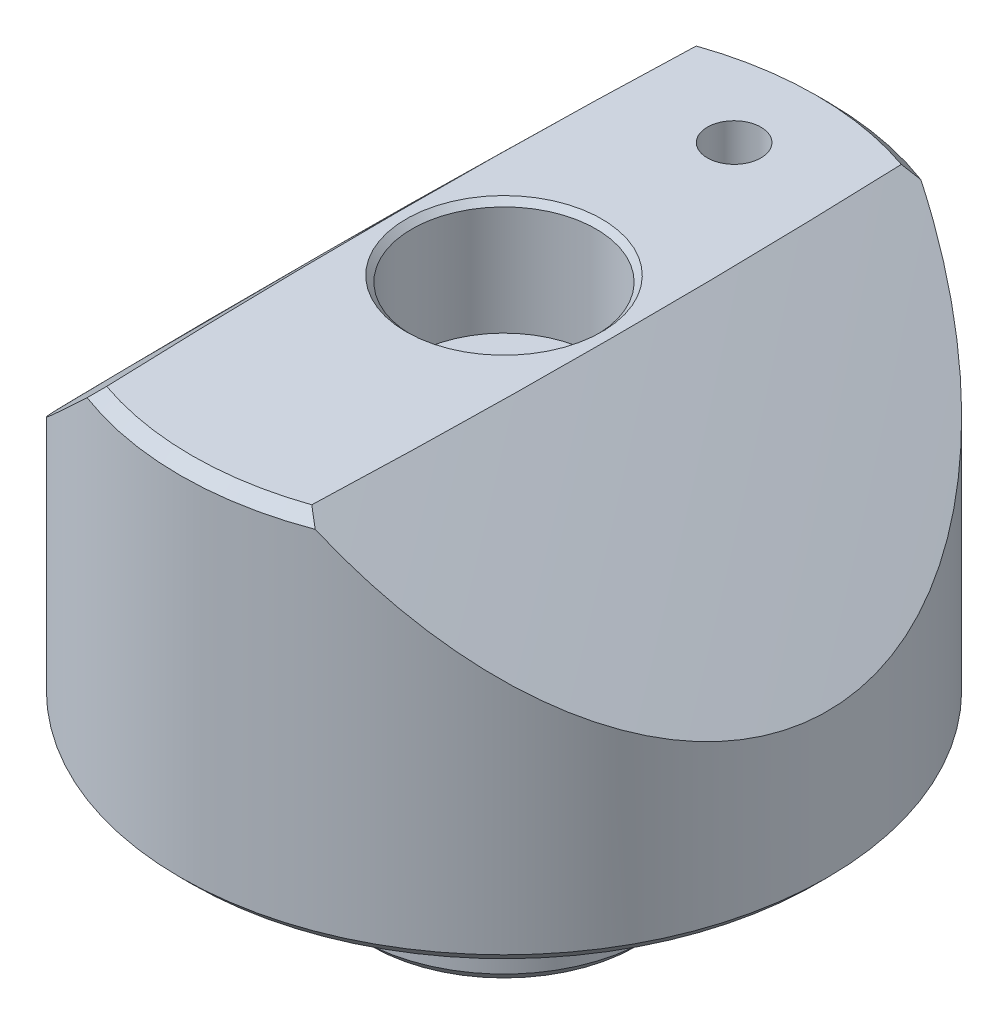
ISO-10303-21;
HEADER;
FILE_DESCRIPTION(('STEP AP214'),'2;1');
FILE_NAME('part.step','',(''),(''),'','','');
FILE_SCHEMA(('AUTOMOTIVE_DESIGN { 1 0 10303 214 1 1 1 1 }'));
ENDSEC;
DATA;
#1=APPLICATION_CONTEXT('core data for automotive mechanical design processes');
#2=APPLICATION_PROTOCOL_DEFINITION('international standard','automotive_design',2000,#1);
#3=PRODUCT_CONTEXT('',#1,'mechanical');
#4=PRODUCT('Part','Part','',(#3));
#5=PRODUCT_RELATED_PRODUCT_CATEGORY('part','',(#4));
#6=PRODUCT_DEFINITION_FORMATION('','',#4);
#7=PRODUCT_DEFINITION_CONTEXT('part definition',#1,'design');
#8=PRODUCT_DEFINITION('design','',#6,#7);
#9=PRODUCT_DEFINITION_SHAPE('','',#8);
#10=(LENGTH_UNIT() NAMED_UNIT(*) SI_UNIT(.MILLI.,.METRE.));
#11=(NAMED_UNIT(*) PLANE_ANGLE_UNIT() SI_UNIT($,.RADIAN.));
#12=(NAMED_UNIT(*) SI_UNIT($,.STERADIAN.) SOLID_ANGLE_UNIT());
#13=UNCERTAINTY_MEASURE_WITH_UNIT(LENGTH_MEASURE(1.E-05),#10,'distance_accuracy_value','');
#14=(GEOMETRIC_REPRESENTATION_CONTEXT(3) GLOBAL_UNCERTAINTY_ASSIGNED_CONTEXT((#13)) GLOBAL_UNIT_ASSIGNED_CONTEXT((#10,
#11,#12)) REPRESENTATION_CONTEXT('',''));
#15=CARTESIAN_POINT('',(0.,0.,0.));
#16=DIRECTION('',(0.,0.,1.));
#17=DIRECTION('',(1.,0.,0.));
#18=AXIS2_PLACEMENT_3D('',#15,#16,#17);
#19=CARTESIAN_POINT('',(0.,0.,0.));
#20=DIRECTION('',(0.,1.,0.));
#21=DIRECTION('',(0.,0.,1.));
#22=AXIS2_PLACEMENT_3D('',#19,#20,#21);
#23=PLANE('',#22);
#24=CARTESIAN_POINT('',(0.,0.,-10.16));
#25=DIRECTION('',(0.,1.,0.));
#26=DIRECTION('',(0.,0.,1.));
#27=AXIS2_PLACEMENT_3D('',#24,#25,#26);
#28=CIRCLE('',#27,1.1811);
#29=CARTESIAN_POINT('',(0.,0.,-8.9789));
#30=VERTEX_POINT('',#29);
#31=EDGE_CURVE('E181',#30,#30,#28,.T.);
#32=ORIENTED_EDGE('',*,*,#31,.T.);
#33=EDGE_LOOP('',(#32));
#34=FACE_BOUND('',#33,.T.);
#35=CARTESIAN_POINT('',(0.,0.,0.));
#36=DIRECTION('',(0.,1.,0.));
#37=DIRECTION('',(0.,0.,1.));
#38=AXIS2_PLACEMENT_3D('',#35,#36,#37);
#39=CIRCLE('',#38,13.7795);
#40=CARTESIAN_POINT('',(0.,0.,13.7795));
#41=VERTEX_POINT('',#40);
#42=EDGE_CURVE('E108',#41,#41,#39,.F.);
#43=ORIENTED_EDGE('',*,*,#42,.T.);
#44=EDGE_LOOP('',(#43));
#45=FACE_BOUND('',#44,.T.);
#46=CARTESIAN_POINT('',(0.,0.,0.));
#47=DIRECTION('',(0.,1.,0.));
#48=DIRECTION('',(0.,0.,1.));
#49=AXIS2_PLACEMENT_3D('',#46,#47,#48);
#50=CIRCLE('',#49,7.24802561210692);
#51=CARTESIAN_POINT('',(0.,0.,7.24802561210692));
#52=VERTEX_POINT('',#51);
#53=EDGE_CURVE('E219',#52,#52,#50,.F.);
#54=ORIENTED_EDGE('',*,*,#53,.F.);
#55=EDGE_LOOP('',(#54));
#56=FACE_BOUND('',#55,.T.);
#57=ADVANCED_FACE('F34',(#34,#45,#56),#23,.F.);
#58=CARTESIAN_POINT('',(0.,16.383,0.));
#59=DIRECTION('',(0.,-1.,0.));
#60=DIRECTION('',(0.,0.,-1.));
#61=AXIS2_PLACEMENT_3D('',#58,#59,#60);
#62=CONICAL_SURFACE('',#61,13.7795,0.785398163397452);
#63=CARTESIAN_POINT('',(0.,16.383,0.));
#64=DIRECTION('',(0.,1.,0.));
#65=DIRECTION('',(0.,0.,1.));
#66=AXIS2_PLACEMENT_3D('',#63,#64,#65);
#67=CIRCLE('',#66,13.7795);
#68=CARTESIAN_POINT('',(4.52742325237346,16.383,-13.0144941870158));
#69=VERTEX_POINT('',#68);
#70=CARTESIAN_POINT('',(-4.52742325237346,16.383,-13.0144941870158));
#71=VERTEX_POINT('',#70);
#72=EDGE_CURVE('E113',#69,#71,#67,.T.);
#73=ORIENTED_EDGE('',*,*,#72,.F.);
#74=CARTESIAN_POINT('',(4.52722295690128,16.3832,-13.014352107904));
#75=CARTESIAN_POINT('',(4.61181805516265,16.2987301324419,-13.074348995123));
#76=CARTESIAN_POINT('',(4.69648227601538,16.2141285269333,-13.1340594733926));
#77=CARTESIAN_POINT('',(4.86594894271498,16.0446618602039,-13.2529075978746));
#78=CARTESIAN_POINT('',(4.9507513885289,15.9597967990458,-13.3120452442235));
#79=CARTESIAN_POINT('',(5.03562295690124,15.8748,-13.3708964817595));
#80=B_SPLINE_CURVE_WITH_KNOTS('',3,(#74,#75,#76,#77,#78,#79),.UNSPECIFIED.,.F.,.F.,(4,2,4),(0.,
0.401269520972732,0.802538946338954),.UNSPECIFIED.);
#81=CARTESIAN_POINT('',(5.03542325237344,15.875,-13.3707579784939));
#82=VERTEX_POINT('',#81);
#83=EDGE_CURVE('E94',#69,#82,#80,.T.);
#84=ORIENTED_EDGE('',*,*,#83,.T.);
#85=CARTESIAN_POINT('',(0.,15.875,0.));
#86=DIRECTION('',(0.,1.,0.));
#87=DIRECTION('',(0.,0.,1.));
#88=AXIS2_PLACEMENT_3D('',#85,#86,#87);
#89=CIRCLE('',#88,14.2875);
#90=CARTESIAN_POINT('',(-5.03542325237344,15.875,-13.3707579784939));
#91=VERTEX_POINT('',#90);
#92=EDGE_CURVE('E93',#91,#82,#89,.F.);
#93=ORIENTED_EDGE('',*,*,#92,.F.);
#94=CARTESIAN_POINT('',(-5.03562295690127,15.8748,-13.3708964817595));
#95=CARTESIAN_POINT('',(-4.95075138852892,15.9597967990458,-13.3120452442235));
#96=CARTESIAN_POINT('',(-4.86594894271499,16.0446618602039,-13.2529075978746));
#97=CARTESIAN_POINT('',(-4.69648227601538,16.2141285269333,-13.1340594733926));
#98=CARTESIAN_POINT('',(-4.61181805516264,16.2987301324419,-13.074348995123));
#99=CARTESIAN_POINT('',(-4.52722295690125,16.3832,-13.0143521079041));
#100=B_SPLINE_CURVE_WITH_KNOTS('',3,(#94,#95,#96,#97,#98,#99),.UNSPECIFIED.,.F.,.F.,(4,2,4),(0.,
0.401269425366218,0.802538946338953),.UNSPECIFIED.);
#101=EDGE_CURVE('E148',#91,#71,#100,.T.);
#102=ORIENTED_EDGE('',*,*,#101,.T.);
#103=EDGE_LOOP('',(#73,#84,#93,#102));
#104=FACE_BOUND('',#103,.T.);
#105=ADVANCED_FACE('F124',(#104),#62,.T.);
#106=CARTESIAN_POINT('',(0.,16.383,0.));
#107=DIRECTION('',(0.,-1.,0.));
#108=DIRECTION('',(0.,0.,-1.));
#109=AXIS2_PLACEMENT_3D('',#106,#107,#108);
#110=CYLINDRICAL_SURFACE('',#109,14.2875);
#111=CARTESIAN_POINT('',(0.,0.508000000000005,0.));
#112=DIRECTION('',(0.,1.,0.));
#113=DIRECTION('',(0.,0.,1.));
#114=AXIS2_PLACEMENT_3D('',#111,#112,#113);
#115=CIRCLE('',#114,14.2875);
#116=CARTESIAN_POINT('',(0.,0.508000000000005,14.2875));
#117=VERTEX_POINT('',#116);
#118=EDGE_CURVE('E100',#117,#117,#115,.T.);
#119=ORIENTED_EDGE('',*,*,#118,.T.);
#120=EDGE_LOOP('',(#119));
#121=FACE_BOUND('',#120,.T.);
#122=CARTESIAN_POINT('',(5.03521524078568,15.8752000000002,13.3708363137449));
#123=CARTESIAN_POINT('',(5.24435047936504,15.6741198731854,13.2920736008828));
#124=CARTESIAN_POINT('',(5.45237204060643,15.4739405681317,13.2081398792422));
#125=CARTESIAN_POINT('',(5.86591596766525,15.0756560246645,13.0297522154154));
#126=CARTESIAN_POINT('',(6.07143808076123,14.87755099626,12.935297219063));
#127=CARTESIAN_POINT('',(6.68444450340339,14.2861798689911,12.6355856316907));
#128=CARTESIAN_POINT('',(7.08769096439448,13.8965096184802,12.4142358873083));
#129=CARTESIAN_POINT('',(7.88387411481151,13.1259046146372,11.9246813301953));
#130=CARTESIAN_POINT('',(8.2766499157757,12.7451119182438,11.65599077169));
#131=CARTESIAN_POINT('',(9.04307893881021,12.0009166142973,11.0719131725258));
#132=CARTESIAN_POINT('',(9.41674727932048,11.6375002732749,10.7565638438743));
#133=CARTESIAN_POINT('',(10.0296132340179,11.0405814861955,10.1812653448069));
#134=CARTESIAN_POINT('',(10.2750060441701,10.8013189333861,9.93383922131895));
#135=CARTESIAN_POINT('',(10.752370776612,10.3354294090908,9.41506382339818));
#136=CARTESIAN_POINT('',(10.9843408618971,10.1088041672727,9.14371128721441));
#137=CARTESIAN_POINT('',(11.4316780846879,9.67137824042843,8.57782141172306));
#138=CARTESIAN_POINT('',(11.6471014328251,9.46052405028466,8.28337012330595));
#139=CARTESIAN_POINT('',(12.059553412734,9.05648537191586,7.67047396148952));
#140=CARTESIAN_POINT('',(12.2565878987981,8.86329526054134,7.35203678300022));
#141=CARTESIAN_POINT('',(12.5924282420514,8.5337631838079,6.75691899714235));
#142=CARTESIAN_POINT('',(12.7350453383546,8.39373264647383,6.48442680497846));
#143=CARTESIAN_POINT('',(13.0047674981344,8.12875985680675,5.92495110820769));
#144=CARTESIAN_POINT('',(13.131880165856,8.00381020827421,5.6379748058617));
#145=CARTESIAN_POINT('',(13.3689162418281,7.77069905118793,5.05026241003214));
#146=CARTESIAN_POINT('',(13.4788343388799,7.66254272996996,4.74952210194278));
#147=CARTESIAN_POINT('',(13.6796361150475,7.4648830553673,4.135752660442));
#148=CARTESIAN_POINT('',(13.7705196180322,7.37537987458408,3.82272341335027));
#149=CARTESIAN_POINT('',(13.9322291776594,7.21607872104049,3.18358385502761));
#150=CARTESIAN_POINT('',(14.0028782275511,7.14645466210971,2.8573849883133));
#151=CARTESIAN_POINT('',(14.1215669504467,7.02946390504839,2.19694072635212));
#152=CARTESIAN_POINT('',(14.1696065197624,6.98209730899174,1.86269529421066));
#153=CARTESIAN_POINT('',(14.2419286655316,6.91078088176215,1.1894012772535));
#154=CARTESIAN_POINT('',(14.2662284338308,6.88681410495877,0.850356348910398));
#155=CARTESIAN_POINT('',(14.2905278845514,6.86284767059779,0.170571456286731));
#156=CARTESIAN_POINT('',(14.290530749317,6.86284487430124,-0.170168280166154));
#157=CARTESIAN_POINT('',(14.2679222423542,6.88514348424529,-0.803249986841322));
#158=CARTESIAN_POINT('',(14.2484125311997,6.90438575213812,-1.09582001186282));
#159=CARTESIAN_POINT('',(14.1916858889861,6.96032583001074,-1.67752216949968));
#160=CARTESIAN_POINT('',(14.1544709367755,6.99702168926789,-1.96665468261218));
#161=CARTESIAN_POINT('',(14.0629817853964,7.08721384972374,-2.53956178885961));
#162=CARTESIAN_POINT('',(14.0087056616879,7.14071204626468,-2.82333577370998));
#163=CARTESIAN_POINT('',(13.8839851327656,7.26360812758226,-3.38379119827849));
#164=CARTESIAN_POINT('',(13.813539872834,7.3330068528775,-3.6604722621974));
#165=CARTESIAN_POINT('',(13.6567016858424,7.48745889337918,-4.20822923010808));
#166=CARTESIAN_POINT('',(13.5701455087197,7.57267242988083,-4.47921294191804));
#167=CARTESIAN_POINT('',(13.382759400332,7.75707300775283,-5.01138988309089));
#168=CARTESIAN_POINT('',(13.2819247179018,7.85626470029431,-5.27257981684105));
#169=CARTESIAN_POINT('',(13.0672684367221,8.06732166505759,-5.78412155354329));
#170=CARTESIAN_POINT('',(12.9534519131542,8.17918198442751,-6.03447753952665));
#171=CARTESIAN_POINT('',(12.713993335665,8.41440021404323,-6.52390131336048));
#172=CARTESIAN_POINT('',(12.5883487644383,8.53776057173131,-6.76296668195289));
#173=CARTESIAN_POINT('',(12.2606252772963,8.85934119569476,-7.3465021503992));
#174=CARTESIAN_POINT('',(12.0518324665611,9.06406052265623,-7.68365838010624));
#175=CARTESIAN_POINT('',(11.6137204059389,9.4932113028934,-8.33109208190593));
#176=CARTESIAN_POINT('',(11.3843913015231,9.71765221877498,-8.64135650767014));
#177=CARTESIAN_POINT('',(10.9072621936464,10.1841295456204,-9.23636181820497));
#178=CARTESIAN_POINT('',(10.6593800120737,10.4262441063731,-9.52097513720146));
#179=CARTESIAN_POINT('',(10.1489147134787,10.9242874140674,-10.0633424565146));
#180=CARTESIAN_POINT('',(9.88633534378695,11.1802126391232,-10.321103255872));
#181=CARTESIAN_POINT('',(9.26554673238644,11.784579872323,-10.8861756285345));
#182=CARTESIAN_POINT('',(8.9028697457337,12.1371631834772,-11.184169772111));
#183=CARTESIAN_POINT('',(8.16026051987733,12.8579761029716,-11.7370040789373));
#184=CARTESIAN_POINT('',(7.7803173927044,13.2262155743342,-11.9918165193151));
#185=CARTESIAN_POINT('',(7.01162857844479,13.9700271393307,-12.456680217414));
#186=CARTESIAN_POINT('',(6.6230526398135,14.3454497211574,-12.6672519100146));
#187=CARTESIAN_POINT('',(6.03268473594591,14.9149100257504,-12.9532658741737));
#188=CARTESIAN_POINT('',(5.83478000039933,15.1056544966023,-13.043579345899));
#189=CARTESIAN_POINT('',(5.43666536822023,15.4890548590001,-13.2144697878173));
#190=CARTESIAN_POINT('',(5.23645566818627,15.6817105873372,-13.2950475817599));
#191=CARTESIAN_POINT('',(5.03521524078563,15.8752000000001,-13.3708363137449));
#192=B_SPLINE_CURVE_WITH_KNOTS('',3,(#122,#123,#124,#125,#126,#127,#128,#129,#130,#131,#132,
#133,#134,#135,#136,#137,#138,#139,#140,#141,#142,#143,#144,#145,#146,#147,#148,#149,#150,#151,
#152,#153,#154,#155,#156,#157,#158,#159,#160,#161,#162,#163,#164,#165,#166,#167,#168,#169,#170,
#171,#172,#173,#174,#175,#176,#177,#178,#179,#180,#181,#182,#183,#184,#185,#186,#187,#188,#189,
#190,#191),.UNSPECIFIED.,.F.,.F.,(4,2,2,2,2,2,2,2,2,2,2,2,2,2,2,2,2,2,2,2,2,2,2,2,2,2,2,2,2,2,2,
2,2,2,4),(0.,0.901770943201729,1.80363231963582,3.61027002537981,5.43665700748803,
7.26157579343089,8.52876707651852,9.79613137641681,11.0589801266956,12.321425454142,
13.3343231512112,14.3467220514192,15.3594330547526,16.3721534284998,17.3934796809797,
18.4148106172693,19.4354013785202,20.4558584654833,21.3363521046419,22.2167473574352,
23.0972419565257,23.9777831102259,24.8677872427461,25.7580882226542,26.6480423294917,
27.5381862709587,28.8750608793705,30.2125804725693,31.5564217351691,32.8999219067661,
34.6587760730672,36.4187551895694,38.1567008888143,39.0245105459874,39.8922467250579),.UNSPECIFIED.);
#193=CARTESIAN_POINT('',(5.03542325237342,15.875,13.3707579784939));
#194=VERTEX_POINT('',#193);
#195=EDGE_CURVE('E82',#194,#82,#192,.T.);
#196=ORIENTED_EDGE('',*,*,#195,.F.);
#197=CARTESIAN_POINT('',(-5.03542325237338,15.875,13.3707579784939));
#198=VERTEX_POINT('',#197);
#199=EDGE_CURVE('E57',#194,#198,#89,.F.);
#200=ORIENTED_EDGE('',*,*,#199,.T.);
#201=CARTESIAN_POINT('',(-5.03521524078568,15.8752000000002,-13.3708363137449));
#202=CARTESIAN_POINT('',(-5.24435047936504,15.6741198731854,-13.2920736008828));
#203=CARTESIAN_POINT('',(-5.45237204060643,15.4739405681317,-13.2081398792422));
#204=CARTESIAN_POINT('',(-5.86591596766525,15.0756560246645,-13.0297522154154));
#205=CARTESIAN_POINT('',(-6.07143808076123,14.87755099626,-12.935297219063));
#206=CARTESIAN_POINT('',(-6.68444450340339,14.2861798689911,-12.6355856316907));
#207=CARTESIAN_POINT('',(-7.08769096439448,13.8965096184802,-12.4142358873083));
#208=CARTESIAN_POINT('',(-7.88387411481151,13.1259046146372,-11.9246813301953));
#209=CARTESIAN_POINT('',(-8.2766499157757,12.7451119182438,-11.65599077169));
#210=CARTESIAN_POINT('',(-9.04307893881021,12.0009166142973,-11.0719131725258));
#211=CARTESIAN_POINT('',(-9.41674727932048,11.6375002732749,-10.7565638438743));
#212=CARTESIAN_POINT('',(-10.0296132340179,11.0405814861955,-10.1812653448069));
#213=CARTESIAN_POINT('',(-10.2750060441701,10.8013189333861,-9.93383922131895));
#214=CARTESIAN_POINT('',(-10.752370776612,10.3354294090908,-9.41506382339818));
#215=CARTESIAN_POINT('',(-10.9843408618971,10.1088041672727,-9.14371128721441));
#216=CARTESIAN_POINT('',(-11.4316780846879,9.67137824042843,-8.57782141172306));
#217=CARTESIAN_POINT('',(-11.6471014328251,9.46052405028466,-8.28337012330595));
#218=CARTESIAN_POINT('',(-12.059553412734,9.05648537191586,-7.67047396148952));
#219=CARTESIAN_POINT('',(-12.2565878987981,8.86329526054134,-7.35203678300022));
#220=CARTESIAN_POINT('',(-12.5924282420514,8.5337631838079,-6.75691899714235));
#221=CARTESIAN_POINT('',(-12.7350453383546,8.39373264647383,-6.48442680497846));
#222=CARTESIAN_POINT('',(-13.0047674981344,8.12875985680675,-5.92495110820769));
#223=CARTESIAN_POINT('',(-13.131880165856,8.00381020827421,-5.6379748058617));
#224=CARTESIAN_POINT('',(-13.3689162418281,7.77069905118793,-5.05026241003214));
#225=CARTESIAN_POINT('',(-13.4788343388799,7.66254272996996,-4.74952210194278));
#226=CARTESIAN_POINT('',(-13.6796361150475,7.4648830553673,-4.135752660442));
#227=CARTESIAN_POINT('',(-13.7705196180322,7.37537987458408,-3.82272341335027));
#228=CARTESIAN_POINT('',(-13.9322291776594,7.21607872104049,-3.18358385502761));
#229=CARTESIAN_POINT('',(-14.0028782275511,7.14645466210971,-2.8573849883133));
#230=CARTESIAN_POINT('',(-14.1215669504467,7.02946390504839,-2.19694072635212));
#231=CARTESIAN_POINT('',(-14.1696065197624,6.98209730899174,-1.86269529421066));
#232=CARTESIAN_POINT('',(-14.2419286655316,6.91078088176215,-1.1894012772535));
#233=CARTESIAN_POINT('',(-14.2662284338308,6.88681410495877,-0.850356348910398));
#234=CARTESIAN_POINT('',(-14.2905278845514,6.86284767059779,-0.170571456286731));
#235=CARTESIAN_POINT('',(-14.290530749317,6.86284487430124,0.170168280166154));
#236=CARTESIAN_POINT('',(-14.2679222423542,6.88514348424529,0.803249986841322));
#237=CARTESIAN_POINT('',(-14.2484125311997,6.90438575213812,1.09582001186282));
#238=CARTESIAN_POINT('',(-14.1916858889861,6.96032583001074,1.67752216949968));
#239=CARTESIAN_POINT('',(-14.1544709367755,6.99702168926789,1.96665468261218));
#240=CARTESIAN_POINT('',(-14.0629817853964,7.08721384972374,2.53956178885961));
#241=CARTESIAN_POINT('',(-14.0087056616879,7.14071204626468,2.82333577370998));
#242=CARTESIAN_POINT('',(-13.8839851327656,7.26360812758226,3.38379119827849));
#243=CARTESIAN_POINT('',(-13.813539872834,7.3330068528775,3.6604722621974));
#244=CARTESIAN_POINT('',(-13.6567016858424,7.48745889337918,4.20822923010808));
#245=CARTESIAN_POINT('',(-13.5701455087197,7.57267242988083,4.47921294191804));
#246=CARTESIAN_POINT('',(-13.382759400332,7.75707300775283,5.01138988309089));
#247=CARTESIAN_POINT('',(-13.2819247179018,7.85626470029431,5.27257981684105));
#248=CARTESIAN_POINT('',(-13.0672684367221,8.06732166505759,5.78412155354329));
#249=CARTESIAN_POINT('',(-12.9534519131542,8.17918198442751,6.03447753952665));
#250=CARTESIAN_POINT('',(-12.713993335665,8.41440021404323,6.52390131336048));
#251=CARTESIAN_POINT('',(-12.5883487644383,8.53776057173131,6.76296668195289));
#252=CARTESIAN_POINT('',(-12.2606252772963,8.85934119569476,7.3465021503992));
#253=CARTESIAN_POINT('',(-12.0518324665611,9.06406052265623,7.68365838010624));
#254=CARTESIAN_POINT('',(-11.6137204059389,9.4932113028934,8.33109208190593));
#255=CARTESIAN_POINT('',(-11.3843913015231,9.71765221877498,8.64135650767014));
#256=CARTESIAN_POINT('',(-10.9072621936464,10.1841295456204,9.23636181820497));
#257=CARTESIAN_POINT('',(-10.6593800120737,10.4262441063731,9.52097513720146));
#258=CARTESIAN_POINT('',(-10.1489147134787,10.9242874140674,10.0633424565146));
#259=CARTESIAN_POINT('',(-9.88633534378695,11.1802126391232,10.321103255872));
#260=CARTESIAN_POINT('',(-9.26554673238644,11.784579872323,10.8861756285345));
#261=CARTESIAN_POINT('',(-8.9028697457337,12.1371631834772,11.184169772111));
#262=CARTESIAN_POINT('',(-8.16026051987733,12.8579761029716,11.7370040789373));
#263=CARTESIAN_POINT('',(-7.7803173927044,13.2262155743342,11.9918165193151));
#264=CARTESIAN_POINT('',(-7.01162857844479,13.9700271393307,12.456680217414));
#265=CARTESIAN_POINT('',(-6.6230526398135,14.3454497211574,12.6672519100146));
#266=CARTESIAN_POINT('',(-6.03268473594591,14.9149100257504,12.9532658741737));
#267=CARTESIAN_POINT('',(-5.83478000039933,15.1056544966023,13.043579345899));
#268=CARTESIAN_POINT('',(-5.43666536822023,15.4890548590001,13.2144697878173));
#269=CARTESIAN_POINT('',(-5.23645566818627,15.6817105873372,13.2950475817599));
#270=CARTESIAN_POINT('',(-5.03521524078563,15.8752000000001,13.3708363137449));
#271=B_SPLINE_CURVE_WITH_KNOTS('',3,(#201,#202,#203,#204,#205,#206,#207,#208,#209,#210,#211,
#212,#213,#214,#215,#216,#217,#218,#219,#220,#221,#222,#223,#224,#225,#226,#227,#228,#229,#230,
#231,#232,#233,#234,#235,#236,#237,#238,#239,#240,#241,#242,#243,#244,#245,#246,#247,#248,#249,
#250,#251,#252,#253,#254,#255,#256,#257,#258,#259,#260,#261,#262,#263,#264,#265,#266,#267,#268,
#269,#270),.UNSPECIFIED.,.F.,.F.,(4,2,2,2,2,2,2,2,2,2,2,2,2,2,2,2,2,2,2,2,2,2,2,2,2,2,2,2,2,2,2,
2,2,2,4),(0.,0.901770943201729,1.80363231963582,3.61027002537981,5.43665700748803,
7.26157579343089,8.52876707651852,9.79613137641681,11.0589801266956,12.321425454142,
13.3343231512112,14.3467220514192,15.3594330547526,16.3721534284998,17.3934796809797,
18.4148106172693,19.4354013785202,20.4558584654833,21.3363521046419,22.2167473574352,
23.0972419565257,23.9777831102259,24.8677872427461,25.7580882226542,26.6480423294917,
27.5381862709587,28.8750608793705,30.2125804725693,31.5564217351691,32.8999219067661,
34.6587760730672,36.4187551895694,38.1567008888143,39.0245105459874,39.8922467250579),.UNSPECIFIED.);
#272=EDGE_CURVE('E142',#91,#198,#271,.T.);
#273=ORIENTED_EDGE('',*,*,#272,.F.);
#274=ORIENTED_EDGE('',*,*,#92,.T.);
#275=EDGE_LOOP('',(#196,#200,#273,#274));
#276=FACE_BOUND('',#275,.T.);
#277=ADVANCED_FACE('F91',(#121,#276),#110,.T.);
#278=CARTESIAN_POINT('',(0.,16.383,0.));
#279=DIRECTION('',(0.,1.,0.));
#280=DIRECTION('',(0.,0.,1.));
#281=AXIS2_PLACEMENT_3D('',#278,#279,#280);
#282=PLANE('',#281);
#283=CARTESIAN_POINT('',(0.,16.383,0.));
#284=DIRECTION('',(0.,1.,0.));
#285=DIRECTION('',(0.,0.,1.));
#286=AXIS2_PLACEMENT_3D('',#283,#284,#285);
#287=CIRCLE('',#286,4.31800000000001);
#288=CARTESIAN_POINT('',(0.,16.383,4.31800000000001));
#289=VERTEX_POINT('',#288);
#290=EDGE_CURVE('E11',#289,#289,#287,.F.);
#291=ORIENTED_EDGE('',*,*,#290,.T.);
#292=EDGE_LOOP('',(#291));
#293=FACE_BOUND('',#292,.T.);
#294=CARTESIAN_POINT('',(0.,16.383,-10.16));
#295=DIRECTION('',(0.,1.,0.));
#296=DIRECTION('',(0.,0.,1.));
#297=AXIS2_PLACEMENT_3D('',#294,#295,#296);
#298=CIRCLE('',#297,1.1811);
#299=CARTESIAN_POINT('',(0.,16.383,-8.9789));
#300=VERTEX_POINT('',#299);
#301=EDGE_CURVE('E179',#300,#300,#298,.T.);
#302=ORIENTED_EDGE('',*,*,#301,.F.);
#303=EDGE_LOOP('',(#302));
#304=FACE_BOUND('',#303,.T.);
#305=CARTESIAN_POINT('',(-4.52742325237346,16.383,13.0144941870158));
#306=VERTEX_POINT('',#305);
#307=CARTESIAN_POINT('',(4.5274232523735,16.383,13.0144941870158));
#308=VERTEX_POINT('',#307);
#309=EDGE_CURVE('E111',#306,#308,#67,.T.);
#310=ORIENTED_EDGE('',*,*,#309,.T.);
#311=CARTESIAN_POINT('',(-343.991741395694,16.383,0.));
#312=DIRECTION('',(0.,1.,0.));
#313=DIRECTION('',(0.,0.,1.));
#314=AXIS2_PLACEMENT_3D('',#311,#312,#313);
#315=CIRCLE('',#314,348.762075326333);
#316=EDGE_CURVE('E49',#308,#69,#315,.T.);
#317=ORIENTED_EDGE('',*,*,#316,.T.);
#318=ORIENTED_EDGE('',*,*,#72,.T.);
#319=CARTESIAN_POINT('',(343.991741395694,16.383,0.));
#320=DIRECTION('',(0.,1.,0.));
#321=DIRECTION('',(0.,0.,1.));
#322=AXIS2_PLACEMENT_3D('',#319,#320,#321);
#323=CIRCLE('',#322,348.762075326333);
#324=EDGE_CURVE('E149',#71,#306,#323,.T.);
#325=ORIENTED_EDGE('',*,*,#324,.T.);
#326=EDGE_LOOP('',(#310,#317,#318,#325));
#327=FACE_BOUND('',#326,.T.);
#328=ADVANCED_FACE('F159',(#293,#304,#327),#282,.T.);
#329=ORIENTED_EDGE('',*,*,#199,.F.);
#330=CARTESIAN_POINT('',(5.03562295690128,15.8748,13.3708964817595));
#331=CARTESIAN_POINT('',(4.95075138852893,15.9597967990458,13.3120452442235));
#332=CARTESIAN_POINT('',(4.86594894271499,16.0446618602039,13.2529075978746));
#333=CARTESIAN_POINT('',(4.69648227601538,16.2141285269333,13.1340594733926));
#334=CARTESIAN_POINT('',(4.61181805516264,16.2987301324419,13.074348995123));
#335=CARTESIAN_POINT('',(4.52722295690126,16.3832,13.014352107904));
#336=B_SPLINE_CURVE_WITH_KNOTS('',3,(#330,#331,#332,#333,#334,#335),.UNSPECIFIED.,.F.,.F.,(4,2,
4),(0.,0.401269425366218,0.802538946338952),.UNSPECIFIED.);
#337=EDGE_CURVE('E80',#194,#308,#336,.T.);
#338=ORIENTED_EDGE('',*,*,#337,.T.);
#339=ORIENTED_EDGE('',*,*,#309,.F.);
#340=CARTESIAN_POINT('',(-4.52722295690127,16.3832,13.014352107904));
#341=CARTESIAN_POINT('',(-4.61181805516266,16.2987301324419,13.074348995123));
#342=CARTESIAN_POINT('',(-4.6964822760154,16.2141285269333,13.1340594733926));
#343=CARTESIAN_POINT('',(-4.86594894271501,16.0446618602039,13.2529075978746));
#344=CARTESIAN_POINT('',(-4.95075138852894,15.9597967990458,13.3120452442235));
#345=CARTESIAN_POINT('',(-5.03562295690129,15.8748,13.3708964817595));
#346=B_SPLINE_CURVE_WITH_KNOTS('',3,(#340,#341,#342,#343,#344,#345),.UNSPECIFIED.,.F.,.F.,(4,2,
4),(0.,0.401269520972735,0.802538946338954),.UNSPECIFIED.);
#347=EDGE_CURVE('E88',#306,#198,#346,.T.);
#348=ORIENTED_EDGE('',*,*,#347,.T.);
#349=EDGE_LOOP('',(#329,#338,#339,#348));
#350=FACE_BOUND('',#349,.T.);
#351=ADVANCED_FACE('F97',(#350),#62,.T.);
#352=CARTESIAN_POINT('',(0.,-6.35,-10.16));
#353=DIRECTION('',(0.,1.,0.));
#354=DIRECTION('',(0.,0.,1.));
#355=AXIS2_PLACEMENT_3D('',#352,#353,#354);
#356=CYLINDRICAL_SURFACE('',#355,1.1811);
#357=ORIENTED_EDGE('',*,*,#301,.T.);
#358=EDGE_LOOP('',(#357));
#359=FACE_BOUND('',#358,.T.);
#360=ORIENTED_EDGE('',*,*,#31,.F.);
#361=EDGE_LOOP('',(#360));
#362=FACE_BOUND('',#361,.T.);
#363=ADVANCED_FACE('F136',(#359,#362),#356,.F.);
#364=CARTESIAN_POINT('',(0.,0.508000000000005,0.));
#365=DIRECTION('',(0.,1.,0.));
#366=DIRECTION('',(0.,0.,1.));
#367=AXIS2_PLACEMENT_3D('',#364,#365,#366);
#368=CONICAL_SURFACE('',#367,14.2875,0.78539816339745);
#369=ORIENTED_EDGE('',*,*,#42,.F.);
#370=EDGE_LOOP('',(#369));
#371=FACE_BOUND('',#370,.T.);
#372=ORIENTED_EDGE('',*,*,#118,.F.);
#373=EDGE_LOOP('',(#372));
#374=FACE_BOUND('',#373,.T.);
#375=ADVANCED_FACE('F132',(#371,#374),#368,.T.);
#376=CARTESIAN_POINT('',(343.991741395694,-341.896241395688,0.));
#377=DIRECTION('',(0.,-1.,0.));
#378=DIRECTION('',(-0.999048221581858,0.,0.0436193873653361));
#379=AXIS2_PLACEMENT_3D('',#376,#377,#378);
#380=SPHERICAL_SURFACE('',#379,499.999);
#381=CARTESIAN_POINT('',(-9.56094209080183,11.6564420908017,0.));
#382=VERTEX_POINT('',#381);
#383=VERTEX_LOOP('',#382);
#384=FACE_BOUND('',#383,.T.);
#385=ORIENTED_EDGE('',*,*,#272,.T.);
#386=ORIENTED_EDGE('',*,*,#347,.F.);
#387=ORIENTED_EDGE('',*,*,#324,.F.);
#388=ORIENTED_EDGE('',*,*,#101,.F.);
#389=EDGE_LOOP('',(#385,#386,#387,#388));
#390=FACE_BOUND('',#389,.T.);
#391=ADVANCED_FACE('F128',(#384,#390),#380,.T.);
#392=CARTESIAN_POINT('',(-343.991741395694,-341.896241395688,0.));
#393=DIRECTION('',(0.,-1.,0.));
#394=DIRECTION('',(0.999048221581858,0.,0.0436193873653361));
#395=AXIS2_PLACEMENT_3D('',#392,#393,#394);
#396=SPHERICAL_SURFACE('',#395,499.999);
#397=CARTESIAN_POINT('',(9.56094209079561,11.656442090808,0.));
#398=VERTEX_POINT('',#397);
#399=VERTEX_LOOP('',#398);
#400=FACE_BOUND('',#399,.T.);
#401=ORIENTED_EDGE('',*,*,#316,.F.);
#402=ORIENTED_EDGE('',*,*,#337,.F.);
#403=ORIENTED_EDGE('',*,*,#195,.T.);
#404=ORIENTED_EDGE('',*,*,#83,.F.);
#405=EDGE_LOOP('',(#401,#402,#403,#404));
#406=FACE_BOUND('',#405,.T.);
#407=ADVANCED_FACE('F81',(#400,#406),#396,.T.);
#408=CARTESIAN_POINT('',(0.,-0.449012806053458,0.));
#409=DIRECTION('',(0.,1.,0.));
#410=DIRECTION('',(0.,0.,1.));
#411=AXIS2_PLACEMENT_3D('',#408,#409,#410);
#412=TOROIDAL_SURFACE('',#411,6.79901280605346,0.635000000000001);
#413=ORIENTED_EDGE('',*,*,#53,.T.);
#414=EDGE_LOOP('',(#413));
#415=FACE_BOUND('',#414,.T.);
#416=CARTESIAN_POINT('',(0.,-0.898025612106916,0.));
#417=DIRECTION('',(0.,1.,0.));
#418=DIRECTION('',(0.,0.,1.));
#419=AXIS2_PLACEMENT_3D('',#416,#417,#418);
#420=CIRCLE('',#419,6.35);
#421=CARTESIAN_POINT('',(0.,-0.898025612106916,6.35));
#422=VERTEX_POINT('',#421);
#423=EDGE_CURVE('E221',#422,#422,#420,.T.);
#424=ORIENTED_EDGE('',*,*,#423,.T.);
#425=EDGE_LOOP('',(#424));
#426=FACE_BOUND('',#425,.T.);
#427=ADVANCED_FACE('F203',(#415,#426),#412,.F.);
#428=CARTESIAN_POINT('',(0.,-6.35,0.));
#429=DIRECTION('',(0.,-1.,0.));
#430=DIRECTION('',(0.,0.,-1.));
#431=AXIS2_PLACEMENT_3D('',#428,#429,#430);
#432=PLANE('',#431);
#433=CARTESIAN_POINT('',(0.,-6.35,0.));
#434=DIRECTION('',(0.,-1.,0.));
#435=DIRECTION('',(0.,0.,-1.));
#436=AXIS2_PLACEMENT_3D('',#433,#434,#435);
#437=CIRCLE('',#436,2.80669999999997);
#438=CARTESIAN_POINT('',(0.,-6.35,-2.80669999999997));
#439=VERTEX_POINT('',#438);
#440=EDGE_CURVE('E350',#439,#439,#437,.F.);
#441=ORIENTED_EDGE('',*,*,#440,.T.);
#442=EDGE_LOOP('',(#441));
#443=FACE_BOUND('',#442,.T.);
#444=CARTESIAN_POINT('',(0.,-6.35,0.));
#445=DIRECTION('',(0.,-1.,0.));
#446=DIRECTION('',(0.,0.,-1.));
#447=AXIS2_PLACEMENT_3D('',#444,#445,#446);
#448=CIRCLE('',#447,5.84199999999999);
#449=CARTESIAN_POINT('',(0.,-6.35,-5.84199999999999));
#450=VERTEX_POINT('',#449);
#451=EDGE_CURVE('E102',#450,#450,#448,.T.);
#452=ORIENTED_EDGE('',*,*,#451,.T.);
#453=EDGE_LOOP('',(#452));
#454=FACE_BOUND('',#453,.T.);
#455=ADVANCED_FACE('F189',(#443,#454),#432,.T.);
#456=CARTESIAN_POINT('',(0.,-6.35,0.));
#457=DIRECTION('',(0.,1.,0.));
#458=DIRECTION('',(0.,0.,1.));
#459=AXIS2_PLACEMENT_3D('',#456,#457,#458);
#460=CONICAL_SURFACE('',#459,5.84199999999999,0.785398163397454);
#461=CARTESIAN_POINT('',(0.,-5.842,0.));
#462=DIRECTION('',(0.,-1.,0.));
#463=DIRECTION('',(0.,0.,-1.));
#464=AXIS2_PLACEMENT_3D('',#461,#462,#463);
#465=CIRCLE('',#464,6.35);
#466=CARTESIAN_POINT('',(0.,-5.842,-6.35));
#467=VERTEX_POINT('',#466);
#468=EDGE_CURVE('E98',#467,#467,#465,.F.);
#469=ORIENTED_EDGE('',*,*,#468,.F.);
#470=EDGE_LOOP('',(#469));
#471=FACE_BOUND('',#470,.T.);
#472=ORIENTED_EDGE('',*,*,#451,.F.);
#473=EDGE_LOOP('',(#472));
#474=FACE_BOUND('',#473,.T.);
#475=ADVANCED_FACE('F162',(#471,#474),#460,.T.);
#476=CARTESIAN_POINT('',(0.,-6.35,0.));
#477=DIRECTION('',(0.,1.,0.));
#478=DIRECTION('',(0.,0.,1.));
#479=AXIS2_PLACEMENT_3D('',#476,#477,#478);
#480=CYLINDRICAL_SURFACE('',#479,6.35);
#481=ORIENTED_EDGE('',*,*,#468,.T.);
#482=EDGE_LOOP('',(#481));
#483=FACE_BOUND('',#482,.T.);
#484=ORIENTED_EDGE('',*,*,#423,.F.);
#485=EDGE_LOOP('',(#484));
#486=FACE_BOUND('',#485,.T.);
#487=ADVANCED_FACE('F192',(#483,#486),#480,.T.);
#488=CARTESIAN_POINT('',(0.,16.383,0.));
#489=DIRECTION('',(0.,1.,0.));
#490=DIRECTION('',(0.,0.,1.));
#491=AXIS2_PLACEMENT_3D('',#488,#489,#490);
#492=CYLINDRICAL_SURFACE('',#491,2.55269999999999);
#493=CARTESIAN_POINT('',(0.,11.049,0.));
#494=DIRECTION('',(0.,-1.,0.));
#495=DIRECTION('',(0.,0.,-1.));
#496=AXIS2_PLACEMENT_3D('',#493,#494,#495);
#497=CIRCLE('',#496,2.55269999999999);
#498=CARTESIAN_POINT('',(0.,11.049,-2.55269999999999));
#499=VERTEX_POINT('',#498);
#500=EDGE_CURVE('E357',#499,#499,#497,.F.);
#501=ORIENTED_EDGE('',*,*,#500,.T.);
#502=EDGE_LOOP('',(#501));
#503=FACE_BOUND('',#502,.T.);
#504=CARTESIAN_POINT('',(0.,-6.09600000000001,0.));
#505=DIRECTION('',(0.,-1.,0.));
#506=DIRECTION('',(0.,0.,-1.));
#507=AXIS2_PLACEMENT_3D('',#504,#505,#506);
#508=CIRCLE('',#507,2.55269999999999);
#509=CARTESIAN_POINT('',(0.,-6.09600000000001,-2.55269999999999));
#510=VERTEX_POINT('',#509);
#511=EDGE_CURVE('E87',#510,#510,#508,.T.);
#512=ORIENTED_EDGE('',*,*,#511,.T.);
#513=EDGE_LOOP('',(#512));
#514=FACE_BOUND('',#513,.T.);
#515=ADVANCED_FACE('F199',(#503,#514),#492,.F.);
#516=CARTESIAN_POINT('',(0.,11.303,0.));
#517=DIRECTION('',(0.,-1.,0.));
#518=DIRECTION('',(0.,0.,-1.));
#519=AXIS2_PLACEMENT_3D('',#516,#517,#518);
#520=PLANE('',#519);
#521=CARTESIAN_POINT('',(0.,11.303,0.));
#522=DIRECTION('',(0.,-1.,0.));
#523=DIRECTION('',(0.,0.,-1.));
#524=AXIS2_PLACEMENT_3D('',#521,#522,#523);
#525=CIRCLE('',#524,2.80669999999999);
#526=CARTESIAN_POINT('',(0.,11.303,-2.80669999999999));
#527=VERTEX_POINT('',#526);
#528=EDGE_CURVE('E352',#527,#527,#525,.T.);
#529=ORIENTED_EDGE('',*,*,#528,.T.);
#530=EDGE_LOOP('',(#529));
#531=FACE_BOUND('',#530,.T.);
#532=CARTESIAN_POINT('',(0.,11.303,0.));
#533=DIRECTION('',(0.,1.,0.));
#534=DIRECTION('',(0.,0.,1.));
#535=AXIS2_PLACEMENT_3D('',#532,#533,#534);
#536=CIRCLE('',#535,4.06400000000001);
#537=CARTESIAN_POINT('',(0.,11.303,4.06400000000001));
#538=VERTEX_POINT('',#537);
#539=EDGE_CURVE('E223',#538,#538,#536,.T.);
#540=ORIENTED_EDGE('',*,*,#539,.T.);
#541=EDGE_LOOP('',(#540));
#542=FACE_BOUND('',#541,.T.);
#543=ADVANCED_FACE('F228',(#531,#542),#520,.F.);
#544=CARTESIAN_POINT('',(0.,16.383,0.));
#545=DIRECTION('',(0.,1.,0.));
#546=DIRECTION('',(0.,0.,1.));
#547=AXIS2_PLACEMENT_3D('',#544,#545,#546);
#548=CYLINDRICAL_SURFACE('',#547,4.06400000000001);
#549=CARTESIAN_POINT('',(0.,16.129,0.));
#550=DIRECTION('',(0.,1.,0.));
#551=DIRECTION('',(0.,0.,1.));
#552=AXIS2_PLACEMENT_3D('',#549,#550,#551);
#553=CIRCLE('',#552,4.06400000000001);
#554=CARTESIAN_POINT('',(0.,16.129,4.06400000000001));
#555=VERTEX_POINT('',#554);
#556=EDGE_CURVE('E42',#555,#555,#553,.T.);
#557=ORIENTED_EDGE('',*,*,#556,.T.);
#558=EDGE_LOOP('',(#557));
#559=FACE_BOUND('',#558,.T.);
#560=ORIENTED_EDGE('',*,*,#539,.F.);
#561=EDGE_LOOP('',(#560));
#562=FACE_BOUND('',#561,.T.);
#563=ADVANCED_FACE('F230',(#559,#562),#548,.F.);
#564=CARTESIAN_POINT('',(0.,11.049,0.));
#565=DIRECTION('',(0.,1.,0.));
#566=DIRECTION('',(0.,0.,1.));
#567=AXIS2_PLACEMENT_3D('',#564,#565,#566);
#568=CONICAL_SURFACE('',#567,2.55269999999999,0.785398163397451);
#569=ORIENTED_EDGE('',*,*,#528,.F.);
#570=EDGE_LOOP('',(#569));
#571=FACE_BOUND('',#570,.T.);
#572=ORIENTED_EDGE('',*,*,#500,.F.);
#573=EDGE_LOOP('',(#572));
#574=FACE_BOUND('',#573,.T.);
#575=ADVANCED_FACE('F232',(#571,#574),#568,.F.);
#576=CARTESIAN_POINT('',(0.,-6.35,0.));
#577=DIRECTION('',(0.,-1.,0.));
#578=DIRECTION('',(0.,0.,-1.));
#579=AXIS2_PLACEMENT_3D('',#576,#577,#578);
#580=CONICAL_SURFACE('',#579,2.80669999999997,0.785398163397437);
#581=ORIENTED_EDGE('',*,*,#511,.F.);
#582=EDGE_LOOP('',(#581));
#583=FACE_BOUND('',#582,.T.);
#584=ORIENTED_EDGE('',*,*,#440,.F.);
#585=EDGE_LOOP('',(#584));
#586=FACE_BOUND('',#585,.T.);
#587=ADVANCED_FACE('F239',(#583,#586),#580,.F.);
#588=CARTESIAN_POINT('',(0.,16.129,0.));
#589=DIRECTION('',(0.,1.,0.));
#590=DIRECTION('',(0.,0.,1.));
#591=AXIS2_PLACEMENT_3D('',#588,#589,#590);
#592=CONICAL_SURFACE('',#591,4.06400000000001,0.785398163397431);
#593=ORIENTED_EDGE('',*,*,#290,.F.);
#594=EDGE_LOOP('',(#593));
#595=FACE_BOUND('',#594,.T.);
#596=ORIENTED_EDGE('',*,*,#556,.F.);
#597=EDGE_LOOP('',(#596));
#598=FACE_BOUND('',#597,.T.);
#599=ADVANCED_FACE('F36',(#595,#598),#592,.F.);
#600=CLOSED_SHELL('',(#57,#105,#277,#328,#351,#363,#375,#391,#407,#427,#455,#475,#487,#515,#543,
#563,#575,#587,#599));
#601=MANIFOLD_SOLID_BREP('B2',#600);
#602=ADVANCED_BREP_SHAPE_REPRESENTATION('',(#18,#601),#14);
#603=SHAPE_DEFINITION_REPRESENTATION(#9,#602);
ENDSEC;
END-ISO-10303-21;
